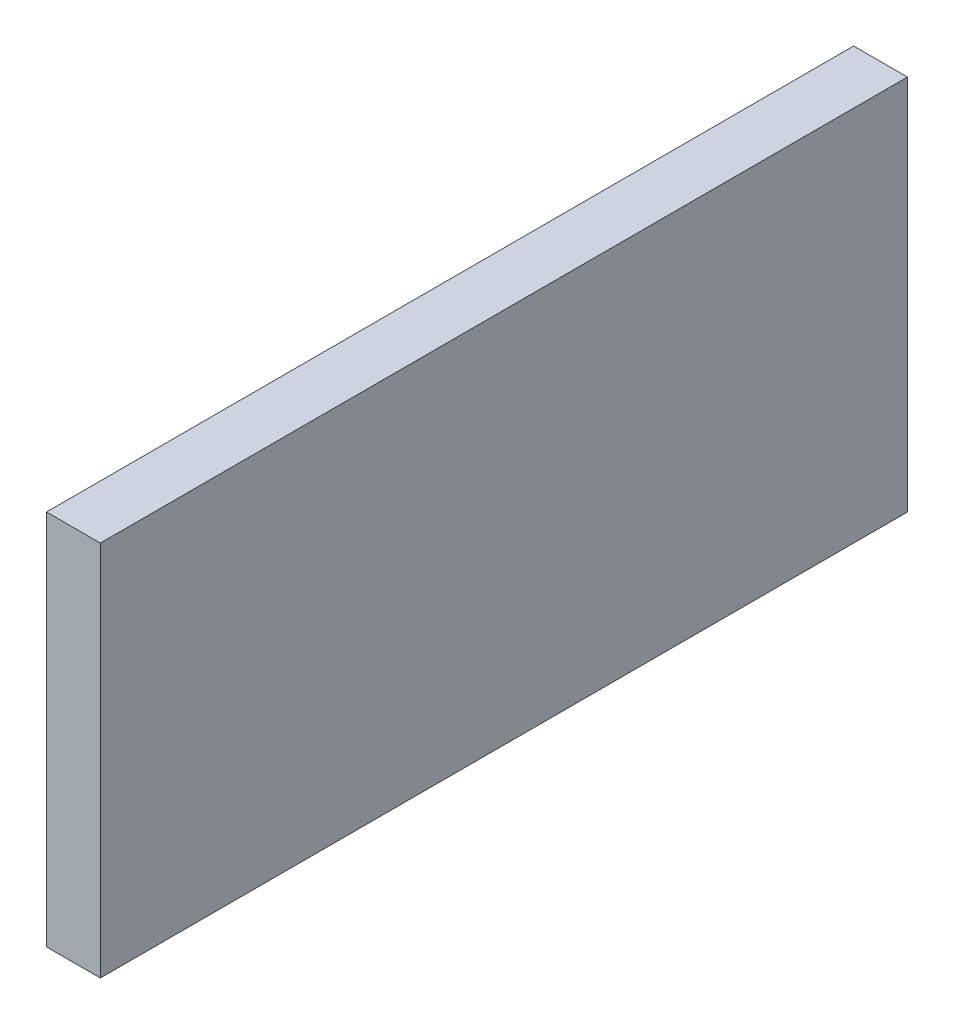
ISO-10303-21;
HEADER;
FILE_DESCRIPTION(('STEP AP214'),'2;1');
FILE_NAME('part.step','',(''),(''),'','','');
FILE_SCHEMA(('AUTOMOTIVE_DESIGN { 1 0 10303 214 1 1 1 1 }'));
ENDSEC;
DATA;
#1=APPLICATION_CONTEXT('core data for automotive mechanical design processes');
#2=APPLICATION_PROTOCOL_DEFINITION('international standard','automotive_design',2000,#1);
#3=PRODUCT_CONTEXT('',#1,'mechanical');
#4=PRODUCT('Part','Part','',(#3));
#5=PRODUCT_RELATED_PRODUCT_CATEGORY('part','',(#4));
#6=PRODUCT_DEFINITION_FORMATION('','',#4);
#7=PRODUCT_DEFINITION_CONTEXT('part definition',#1,'design');
#8=PRODUCT_DEFINITION('design','',#6,#7);
#9=PRODUCT_DEFINITION_SHAPE('','',#8);
#10=(LENGTH_UNIT() NAMED_UNIT(*) SI_UNIT(.MILLI.,.METRE.));
#11=(NAMED_UNIT(*) PLANE_ANGLE_UNIT() SI_UNIT($,.RADIAN.));
#12=(NAMED_UNIT(*) SI_UNIT($,.STERADIAN.) SOLID_ANGLE_UNIT());
#13=UNCERTAINTY_MEASURE_WITH_UNIT(LENGTH_MEASURE(1.E-05),#10,'distance_accuracy_value','');
#14=(GEOMETRIC_REPRESENTATION_CONTEXT(3) GLOBAL_UNCERTAINTY_ASSIGNED_CONTEXT((#13)) GLOBAL_UNIT_ASSIGNED_CONTEXT((#10,
#11,#12)) REPRESENTATION_CONTEXT('',''));
#15=CARTESIAN_POINT('',(0.,0.,0.));
#16=DIRECTION('',(0.,0.,1.));
#17=DIRECTION('',(1.,0.,0.));
#18=AXIS2_PLACEMENT_3D('',#15,#16,#17);
#19=CARTESIAN_POINT('',(0.,-3.5,15.));
#20=DIRECTION('',(0.,-1.,0.));
#21=DIRECTION('',(0.,0.,-1.));
#22=AXIS2_PLACEMENT_3D('',#19,#20,#21);
#23=PLANE('',#22);
#24=DIRECTION('',(0.,0.,-1.));
#25=VECTOR('',#24,1.);
#26=CARTESIAN_POINT('',(1.,-3.5,7.5));
#27=LINE('',#26,#25);
#28=CARTESIAN_POINT('',(1.,-3.5,15.));
#29=VERTEX_POINT('',#28);
#30=CARTESIAN_POINT('',(1.,-3.5,0.));
#31=VERTEX_POINT('',#30);
#32=EDGE_CURVE('E10',#29,#31,#27,.T.);
#33=ORIENTED_EDGE('',*,*,#32,.F.);
#34=DIRECTION('',(1.,0.,0.));
#35=VECTOR('',#34,1.);
#36=CARTESIAN_POINT('',(0.5,-3.5,15.));
#37=LINE('',#36,#35);
#38=CARTESIAN_POINT('',(0.,-3.5,15.));
#39=VERTEX_POINT('',#38);
#40=EDGE_CURVE('E26',#39,#29,#37,.T.);
#41=ORIENTED_EDGE('',*,*,#40,.F.);
#42=DIRECTION('',(0.,0.,-1.));
#43=VECTOR('',#42,1.);
#44=CARTESIAN_POINT('',(0.,-3.5,7.5));
#45=LINE('',#44,#43);
#46=CARTESIAN_POINT('',(0.,-3.5,0.));
#47=VERTEX_POINT('',#46);
#48=EDGE_CURVE('E75',#39,#47,#45,.T.);
#49=ORIENTED_EDGE('',*,*,#48,.T.);
#50=DIRECTION('',(1.,0.,0.));
#51=VECTOR('',#50,1.);
#52=CARTESIAN_POINT('',(0.5,-3.5,0.));
#53=LINE('',#52,#51);
#54=EDGE_CURVE('E35',#47,#31,#53,.T.);
#55=ORIENTED_EDGE('',*,*,#54,.T.);
#56=EDGE_LOOP('',(#33,#41,#49,#55));
#57=FACE_BOUND('',#56,.T.);
#58=ADVANCED_FACE('F15',(#57),#23,.T.);
#59=CARTESIAN_POINT('',(0.,3.5,0.));
#60=DIRECTION('',(0.,0.,1.));
#61=DIRECTION('',(0.,-1.,0.));
#62=AXIS2_PLACEMENT_3D('',#59,#60,#61);
#63=PLANE('',#62);
#64=DIRECTION('',(0.,1.,0.));
#65=VECTOR('',#64,1.);
#66=CARTESIAN_POINT('',(1.,0.,0.));
#67=LINE('',#66,#65);
#68=CARTESIAN_POINT('',(1.,3.5,0.));
#69=VERTEX_POINT('',#68);
#70=EDGE_CURVE('E92',#31,#69,#67,.T.);
#71=ORIENTED_EDGE('',*,*,#70,.F.);
#72=ORIENTED_EDGE('',*,*,#54,.F.);
#73=DIRECTION('',(0.,1.,0.));
#74=VECTOR('',#73,1.);
#75=CARTESIAN_POINT('',(0.,0.,0.));
#76=LINE('',#75,#74);
#77=CARTESIAN_POINT('',(0.,3.5,0.));
#78=VERTEX_POINT('',#77);
#79=EDGE_CURVE('E65',#47,#78,#76,.T.);
#80=ORIENTED_EDGE('',*,*,#79,.T.);
#81=DIRECTION('',(1.,0.,0.));
#82=VECTOR('',#81,1.);
#83=CARTESIAN_POINT('',(0.5,3.5,0.));
#84=LINE('',#83,#82);
#85=EDGE_CURVE('E60',#78,#69,#84,.T.);
#86=ORIENTED_EDGE('',*,*,#85,.T.);
#87=EDGE_LOOP('',(#71,#72,#80,#86));
#88=FACE_BOUND('',#87,.T.);
#89=ADVANCED_FACE('F103',(#88),#63,.F.);
#90=CARTESIAN_POINT('',(0.,3.5,15.));
#91=DIRECTION('',(0.,-1.,0.));
#92=DIRECTION('',(0.,0.,-1.));
#93=AXIS2_PLACEMENT_3D('',#90,#91,#92);
#94=PLANE('',#93);
#95=DIRECTION('',(0.,0.,1.));
#96=VECTOR('',#95,1.);
#97=CARTESIAN_POINT('',(1.,3.5,7.5));
#98=LINE('',#97,#96);
#99=CARTESIAN_POINT('',(1.,3.5,15.));
#100=VERTEX_POINT('',#99);
#101=EDGE_CURVE('E85',#69,#100,#98,.T.);
#102=ORIENTED_EDGE('',*,*,#101,.F.);
#103=ORIENTED_EDGE('',*,*,#85,.F.);
#104=DIRECTION('',(0.,0.,1.));
#105=VECTOR('',#104,1.);
#106=CARTESIAN_POINT('',(0.,3.5,7.5));
#107=LINE('',#106,#105);
#108=CARTESIAN_POINT('',(0.,3.5,15.));
#109=VERTEX_POINT('',#108);
#110=EDGE_CURVE('E58',#78,#109,#107,.T.);
#111=ORIENTED_EDGE('',*,*,#110,.T.);
#112=DIRECTION('',(1.,0.,0.));
#113=VECTOR('',#112,1.);
#114=CARTESIAN_POINT('',(0.5,3.5,15.));
#115=LINE('',#114,#113);
#116=EDGE_CURVE('E54',#109,#100,#115,.T.);
#117=ORIENTED_EDGE('',*,*,#116,.T.);
#118=EDGE_LOOP('',(#102,#103,#111,#117));
#119=FACE_BOUND('',#118,.T.);
#120=ADVANCED_FACE('F59',(#119),#94,.F.);
#121=CARTESIAN_POINT('',(0.,3.5,15.));
#122=DIRECTION('',(0.,0.,1.));
#123=DIRECTION('',(0.,-1.,0.));
#124=AXIS2_PLACEMENT_3D('',#121,#122,#123);
#125=PLANE('',#124);
#126=DIRECTION('',(0.,-1.,0.));
#127=VECTOR('',#126,1.);
#128=CARTESIAN_POINT('',(1.,0.,15.));
#129=LINE('',#128,#127);
#130=EDGE_CURVE('E73',#100,#29,#129,.T.);
#131=ORIENTED_EDGE('',*,*,#130,.F.);
#132=ORIENTED_EDGE('',*,*,#116,.F.);
#133=DIRECTION('',(0.,-1.,0.));
#134=VECTOR('',#133,1.);
#135=CARTESIAN_POINT('',(0.,0.,15.));
#136=LINE('',#135,#134);
#137=EDGE_CURVE('E19',#109,#39,#136,.T.);
#138=ORIENTED_EDGE('',*,*,#137,.T.);
#139=ORIENTED_EDGE('',*,*,#40,.T.);
#140=EDGE_LOOP('',(#131,#132,#138,#139));
#141=FACE_BOUND('',#140,.T.);
#142=ADVANCED_FACE('F70',(#141),#125,.T.);
#143=CARTESIAN_POINT('',(0.,0.,0.));
#144=DIRECTION('',(1.,0.,0.));
#145=DIRECTION('',(0.,0.,-1.));
#146=AXIS2_PLACEMENT_3D('',#143,#144,#145);
#147=PLANE('',#146);
#148=ORIENTED_EDGE('',*,*,#48,.F.);
#149=ORIENTED_EDGE('',*,*,#137,.F.);
#150=ORIENTED_EDGE('',*,*,#110,.F.);
#151=ORIENTED_EDGE('',*,*,#79,.F.);
#152=EDGE_LOOP('',(#148,#149,#150,#151));
#153=FACE_BOUND('',#152,.T.);
#154=ADVANCED_FACE('F77',(#153),#147,.F.);
#155=CARTESIAN_POINT('',(1.,0.,0.));
#156=DIRECTION('',(1.,0.,0.));
#157=DIRECTION('',(0.,0.,-1.));
#158=AXIS2_PLACEMENT_3D('',#155,#156,#157);
#159=PLANE('',#158);
#160=ORIENTED_EDGE('',*,*,#130,.T.);
#161=ORIENTED_EDGE('',*,*,#32,.T.);
#162=ORIENTED_EDGE('',*,*,#70,.T.);
#163=ORIENTED_EDGE('',*,*,#101,.T.);
#164=EDGE_LOOP('',(#160,#161,#162,#163));
#165=FACE_BOUND('',#164,.T.);
#166=ADVANCED_FACE('F17',(#165),#159,.T.);
#167=CLOSED_SHELL('',(#58,#89,#120,#142,#154,#166));
#168=MANIFOLD_SOLID_BREP('B1',#167);
#169=ADVANCED_BREP_SHAPE_REPRESENTATION('',(#18,#168),#14);
#170=SHAPE_DEFINITION_REPRESENTATION(#9,#169);
ENDSEC;
END-ISO-10303-21;
